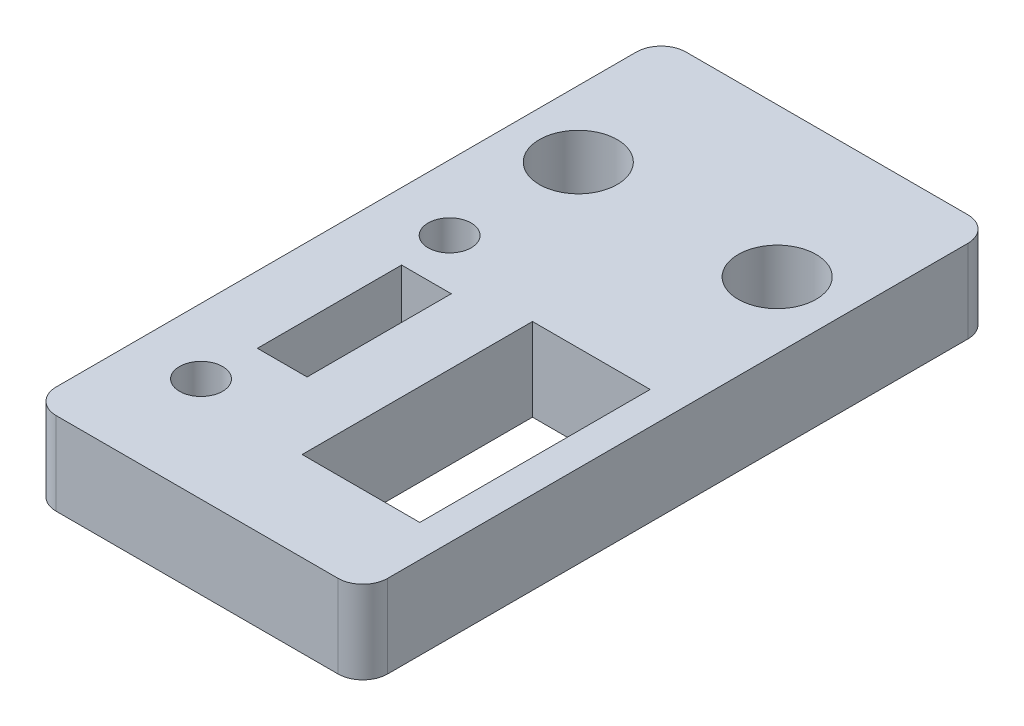
ISO-10303-21;
HEADER;
FILE_DESCRIPTION(('STEP AP214'),'2;1');
FILE_NAME('part.step','',(''),(''),'','','');
FILE_SCHEMA(('AUTOMOTIVE_DESIGN { 1 0 10303 214 1 1 1 1 }'));
ENDSEC;
DATA;
#1=APPLICATION_CONTEXT('core data for automotive mechanical design processes');
#2=APPLICATION_PROTOCOL_DEFINITION('international standard','automotive_design',2000,#1);
#3=PRODUCT_CONTEXT('',#1,'mechanical');
#4=PRODUCT('Part','Part','',(#3));
#5=PRODUCT_RELATED_PRODUCT_CATEGORY('part','',(#4));
#6=PRODUCT_DEFINITION_FORMATION('','',#4);
#7=PRODUCT_DEFINITION_CONTEXT('part definition',#1,'design');
#8=PRODUCT_DEFINITION('design','',#6,#7);
#9=PRODUCT_DEFINITION_SHAPE('','',#8);
#10=(LENGTH_UNIT() NAMED_UNIT(*) SI_UNIT(.MILLI.,.METRE.));
#11=(NAMED_UNIT(*) PLANE_ANGLE_UNIT() SI_UNIT($,.RADIAN.));
#12=(NAMED_UNIT(*) SI_UNIT($,.STERADIAN.) SOLID_ANGLE_UNIT());
#13=UNCERTAINTY_MEASURE_WITH_UNIT(LENGTH_MEASURE(1.E-05),#10,'distance_accuracy_value','');
#14=(GEOMETRIC_REPRESENTATION_CONTEXT(3) GLOBAL_UNCERTAINTY_ASSIGNED_CONTEXT((#13)) GLOBAL_UNIT_ASSIGNED_CONTEXT((#10,
#11,#12)) REPRESENTATION_CONTEXT('',''));
#15=CARTESIAN_POINT('',(0.,0.,0.));
#16=DIRECTION('',(0.,0.,1.));
#17=DIRECTION('',(1.,0.,0.));
#18=AXIS2_PLACEMENT_3D('',#15,#16,#17);
#19=CARTESIAN_POINT('',(-236.,67.49994211399,3.5));
#20=DIRECTION('',(0.,1.,0.));
#21=DIRECTION('',(0.,0.,1.));
#22=AXIS2_PLACEMENT_3D('',#19,#20,#21);
#23=PLANE('',#22);
#24=CARTESIAN_POINT('',(-230.,67.49994211399,-8.));
#25=DIRECTION('',(0.,1.,0.));
#26=DIRECTION('',(0.,0.,1.));
#27=AXIS2_PLACEMENT_3D('',#24,#25,#26);
#28=CIRCLE('',#27,2.35);
#29=CARTESIAN_POINT('',(-230.,67.49994211399,-5.65));
#30=VERTEX_POINT('',#29);
#31=EDGE_CURVE('E201',#30,#30,#28,.F.);
#32=ORIENTED_EDGE('',*,*,#31,.T.);
#33=EDGE_LOOP('',(#32));
#34=FACE_BOUND('',#33,.T.);
#35=CARTESIAN_POINT('',(-242.,67.49994211399,-8.));
#36=DIRECTION('',(0.,1.,0.));
#37=DIRECTION('',(0.,0.,1.));
#38=AXIS2_PLACEMENT_3D('',#35,#36,#37);
#39=CIRCLE('',#38,2.35);
#40=CARTESIAN_POINT('',(-242.,67.49994211399,-5.65));
#41=VERTEX_POINT('',#40);
#42=EDGE_CURVE('E197',#41,#41,#39,.F.);
#43=ORIENTED_EDGE('',*,*,#42,.T.);
#44=EDGE_LOOP('',(#43));
#45=FACE_BOUND('',#44,.T.);
#46=CARTESIAN_POINT('',(-227.5,67.49994211399,-15.5));
#47=DIRECTION('',(0.,-1.,0.));
#48=DIRECTION('',(0.,0.,-1.));
#49=AXIS2_PLACEMENT_3D('',#46,#47,#48);
#50=CIRCLE('',#49,1.5);
#51=CARTESIAN_POINT('',(-227.5,67.49994211399,-17.));
#52=VERTEX_POINT('',#51);
#53=CARTESIAN_POINT('',(-226.,67.49994211399,-15.5));
#54=VERTEX_POINT('',#53);
#55=EDGE_CURVE('E145',#52,#54,#50,.T.);
#56=ORIENTED_EDGE('',*,*,#55,.F.);
#57=DIRECTION('',(-1.,0.,0.));
#58=VECTOR('',#57,1.);
#59=CARTESIAN_POINT('',(-246.,67.49994211399,-17.));
#60=LINE('',#59,#58);
#61=CARTESIAN_POINT('',(-244.5,67.49994211399,-17.));
#62=VERTEX_POINT('',#61);
#63=EDGE_CURVE('E141',#62,#52,#60,.F.);
#64=ORIENTED_EDGE('',*,*,#63,.F.);
#65=CARTESIAN_POINT('',(-244.5,67.49994211399,-15.5));
#66=DIRECTION('',(0.,-1.,0.));
#67=DIRECTION('',(0.,0.,-1.));
#68=AXIS2_PLACEMENT_3D('',#65,#66,#67);
#69=CIRCLE('',#68,1.5);
#70=CARTESIAN_POINT('',(-246.,67.49994211399,-15.5));
#71=VERTEX_POINT('',#70);
#72=EDGE_CURVE('E20',#71,#62,#69,.T.);
#73=ORIENTED_EDGE('',*,*,#72,.F.);
#74=DIRECTION('',(0.,0.,1.));
#75=VECTOR('',#74,1.);
#76=CARTESIAN_POINT('',(-246.,67.49994211399,24.));
#77=LINE('',#76,#75);
#78=CARTESIAN_POINT('',(-246.,67.49994211399,19.5));
#79=VERTEX_POINT('',#78);
#80=EDGE_CURVE('E128',#79,#71,#77,.F.);
#81=ORIENTED_EDGE('',*,*,#80,.F.);
#82=CARTESIAN_POINT('',(-244.5,67.49994211399,19.5));
#83=DIRECTION('',(0.,-1.,0.));
#84=DIRECTION('',(0.,0.,-1.));
#85=AXIS2_PLACEMENT_3D('',#82,#83,#84);
#86=CIRCLE('',#85,1.5);
#87=CARTESIAN_POINT('',(-244.5,67.49994211399,21.));
#88=VERTEX_POINT('',#87);
#89=EDGE_CURVE('E208',#88,#79,#86,.T.);
#90=ORIENTED_EDGE('',*,*,#89,.F.);
#91=DIRECTION('',(1.,0.,0.));
#92=VECTOR('',#91,1.);
#93=CARTESIAN_POINT('',(-226.,67.49994211399,21.));
#94=LINE('',#93,#92);
#95=CARTESIAN_POINT('',(-227.5,67.49994211399,21.));
#96=VERTEX_POINT('',#95);
#97=EDGE_CURVE('E162',#96,#88,#94,.F.);
#98=ORIENTED_EDGE('',*,*,#97,.F.);
#99=CARTESIAN_POINT('',(-227.5,67.49994211399,19.5));
#100=DIRECTION('',(0.,-1.,0.));
#101=DIRECTION('',(0.,0.,-1.));
#102=AXIS2_PLACEMENT_3D('',#99,#100,#101);
#103=CIRCLE('',#102,1.5);
#104=CARTESIAN_POINT('',(-226.,67.49994211399,19.5));
#105=VERTEX_POINT('',#104);
#106=EDGE_CURVE('E207',#105,#96,#103,.T.);
#107=ORIENTED_EDGE('',*,*,#106,.F.);
#108=DIRECTION('',(0.,0.,-1.));
#109=VECTOR('',#108,1.);
#110=CARTESIAN_POINT('',(-226.,67.49994211399,-17.));
#111=LINE('',#110,#109);
#112=EDGE_CURVE('E158',#54,#105,#111,.F.);
#113=ORIENTED_EDGE('',*,*,#112,.F.);
#114=EDGE_LOOP('',(#56,#64,#73,#81,#90,#98,#107,#113));
#115=FACE_BOUND('',#114,.T.);
#116=CARTESIAN_POINT('',(-242.05,67.49994211399,14.7129502600828));
#117=DIRECTION('',(0.,1.,0.));
#118=DIRECTION('',(0.,0.,1.));
#119=AXIS2_PLACEMENT_3D('',#116,#117,#118);
#120=CIRCLE('',#119,1.3);
#121=CARTESIAN_POINT('',(-242.05,67.49994211399,16.0129502600828));
#122=VERTEX_POINT('',#121);
#123=EDGE_CURVE('E190',#122,#122,#120,.F.);
#124=ORIENTED_EDGE('',*,*,#123,.T.);
#125=EDGE_LOOP('',(#124));
#126=FACE_BOUND('',#125,.T.);
#127=CARTESIAN_POINT('',(-242.05,67.49994211399,-0.287049739917195));
#128=DIRECTION('',(0.,1.,0.));
#129=DIRECTION('',(0.,0.,1.));
#130=AXIS2_PLACEMENT_3D('',#127,#128,#129);
#131=CIRCLE('',#130,1.3);
#132=CARTESIAN_POINT('',(-242.05,67.49994211399,1.01295026008281));
#133=VERTEX_POINT('',#132);
#134=EDGE_CURVE('E193',#133,#133,#131,.F.);
#135=ORIENTED_EDGE('',*,*,#134,.T.);
#136=EDGE_LOOP('',(#135));
#137=FACE_BOUND('',#136,.T.);
#138=DIRECTION('',(0.,0.,-1.));
#139=VECTOR('',#138,1.);
#140=CARTESIAN_POINT('',(-238.95,67.49994211399,2.71295026008286));
#141=LINE('',#140,#139);
#142=CARTESIAN_POINT('',(-238.95,67.49994211399,2.71295026008286));
#143=VERTEX_POINT('',#142);
#144=CARTESIAN_POINT('',(-238.95,67.49994211399,11.4129502600829));
#145=VERTEX_POINT('',#144);
#146=EDGE_CURVE('E231',#143,#145,#141,.F.);
#147=ORIENTED_EDGE('',*,*,#146,.T.);
#148=DIRECTION('',(1.,0.,0.));
#149=VECTOR('',#148,1.);
#150=CARTESIAN_POINT('',(-238.95,67.49994211399,11.4129502600829));
#151=LINE('',#150,#149);
#152=CARTESIAN_POINT('',(-241.95,67.49994211399,11.4129502600829));
#153=VERTEX_POINT('',#152);
#154=EDGE_CURVE('E196',#145,#153,#151,.F.);
#155=ORIENTED_EDGE('',*,*,#154,.T.);
#156=DIRECTION('',(0.,0.,1.));
#157=VECTOR('',#156,1.);
#158=CARTESIAN_POINT('',(-241.95,67.49994211399,11.4129502600829));
#159=LINE('',#158,#157);
#160=CARTESIAN_POINT('',(-241.95,67.49994211399,2.71295026008286));
#161=VERTEX_POINT('',#160);
#162=EDGE_CURVE('E241',#153,#161,#159,.F.);
#163=ORIENTED_EDGE('',*,*,#162,.T.);
#164=DIRECTION('',(-1.,0.,0.));
#165=VECTOR('',#164,1.);
#166=CARTESIAN_POINT('',(-241.95,67.49994211399,2.71295026008286));
#167=LINE('',#166,#165);
#168=EDGE_CURVE('E236',#161,#143,#167,.F.);
#169=ORIENTED_EDGE('',*,*,#168,.T.);
#170=EDGE_LOOP('',(#147,#155,#163,#169));
#171=FACE_BOUND('',#170,.T.);
#172=DIRECTION('',(1.,0.,0.));
#173=VECTOR('',#172,1.);
#174=CARTESIAN_POINT('',(-229.95,67.49994211399,15.6129502600828));
#175=LINE('',#174,#173);
#176=CARTESIAN_POINT('',(-227.95,67.49994211399,15.6129502600828));
#177=VERTEX_POINT('',#176);
#178=CARTESIAN_POINT('',(-235.05,67.49994211399,15.6129502600828));
#179=VERTEX_POINT('',#178);
#180=EDGE_CURVE('E200',#177,#179,#175,.F.);
#181=ORIENTED_EDGE('',*,*,#180,.T.);
#182=DIRECTION('',(0.,0.,1.));
#183=VECTOR('',#182,1.);
#184=CARTESIAN_POINT('',(-235.05,67.49994211399,15.6129502600828));
#185=LINE('',#184,#183);
#186=CARTESIAN_POINT('',(-235.05,67.49994211399,1.71295026008287));
#187=VERTEX_POINT('',#186);
#188=EDGE_CURVE('E257',#179,#187,#185,.F.);
#189=ORIENTED_EDGE('',*,*,#188,.T.);
#190=DIRECTION('',(-1.,0.,0.));
#191=VECTOR('',#190,1.);
#192=CARTESIAN_POINT('',(-235.05,67.49994211399,1.71295026008287));
#193=LINE('',#192,#191);
#194=CARTESIAN_POINT('',(-227.95,67.49994211399,1.71295026008287));
#195=VERTEX_POINT('',#194);
#196=EDGE_CURVE('E252',#187,#195,#193,.F.);
#197=ORIENTED_EDGE('',*,*,#196,.T.);
#198=DIRECTION('',(0.,0.,-1.));
#199=VECTOR('',#198,1.);
#200=CARTESIAN_POINT('',(-227.95,67.49994211399,1.71295026008287));
#201=LINE('',#200,#199);
#202=EDGE_CURVE('E246',#195,#177,#201,.F.);
#203=ORIENTED_EDGE('',*,*,#202,.T.);
#204=EDGE_LOOP('',(#181,#189,#197,#203));
#205=FACE_BOUND('',#204,.T.);
#206=ADVANCED_FACE('F17',(#34,#45,#115,#126,#137,#171,#205),#23,.T.);
#207=CARTESIAN_POINT('',(-246.,62.49994211399,-17.));
#208=DIRECTION('',(0.,0.,-1.));
#209=DIRECTION('',(-1.,0.,0.));
#210=AXIS2_PLACEMENT_3D('',#207,#208,#209);
#211=PLANE('',#210);
#212=DIRECTION('',(0.,-1.,0.));
#213=VECTOR('',#212,1.);
#214=CARTESIAN_POINT('',(-227.5,74.01794211399,-17.));
#215=LINE('',#214,#213);
#216=CARTESIAN_POINT('',(-227.5,62.49994211399,-17.));
#217=VERTEX_POINT('',#216);
#218=EDGE_CURVE('E206',#217,#52,#215,.F.);
#219=ORIENTED_EDGE('',*,*,#218,.F.);
#220=DIRECTION('',(1.,0.,0.));
#221=VECTOR('',#220,1.);
#222=CARTESIAN_POINT('',(-236.,62.49994211399,-17.));
#223=LINE('',#222,#221);
#224=CARTESIAN_POINT('',(-244.5,62.49994211399,-17.));
#225=VERTEX_POINT('',#224);
#226=EDGE_CURVE('E152',#217,#225,#223,.F.);
#227=ORIENTED_EDGE('',*,*,#226,.T.);
#228=DIRECTION('',(0.,-1.,0.));
#229=VECTOR('',#228,1.);
#230=CARTESIAN_POINT('',(-244.5,74.01794211399,-17.));
#231=LINE('',#230,#229);
#232=EDGE_CURVE('E137',#62,#225,#231,.T.);
#233=ORIENTED_EDGE('',*,*,#232,.F.);
#234=ORIENTED_EDGE('',*,*,#63,.T.);
#235=EDGE_LOOP('',(#219,#227,#233,#234));
#236=FACE_BOUND('',#235,.T.);
#237=ADVANCED_FACE('F151',(#236),#211,.T.);
#238=CARTESIAN_POINT('',(-244.5,74.01794211399,-15.5));
#239=DIRECTION('',(0.,-1.,0.));
#240=DIRECTION('',(0.,0.,-1.));
#241=AXIS2_PLACEMENT_3D('',#238,#239,#240);
#242=CYLINDRICAL_SURFACE('',#241,1.5);
#243=ORIENTED_EDGE('',*,*,#72,.T.);
#244=ORIENTED_EDGE('',*,*,#232,.T.);
#245=CARTESIAN_POINT('',(-244.5,62.49994211399,-15.5));
#246=DIRECTION('',(0.,-1.,0.));
#247=DIRECTION('',(0.,0.,-1.));
#248=AXIS2_PLACEMENT_3D('',#245,#246,#247);
#249=CIRCLE('',#248,1.5);
#250=CARTESIAN_POINT('',(-246.,62.49994211399,-15.5));
#251=VERTEX_POINT('',#250);
#252=EDGE_CURVE('E188',#225,#251,#249,.F.);
#253=ORIENTED_EDGE('',*,*,#252,.T.);
#254=DIRECTION('',(0.,1.,0.));
#255=VECTOR('',#254,1.);
#256=CARTESIAN_POINT('',(-246.,62.49994211399,-15.5));
#257=LINE('',#256,#255);
#258=EDGE_CURVE('E139',#71,#251,#257,.F.);
#259=ORIENTED_EDGE('',*,*,#258,.F.);
#260=EDGE_LOOP('',(#243,#244,#253,#259));
#261=FACE_BOUND('',#260,.T.);
#262=ADVANCED_FACE('F134',(#261),#242,.T.);
#263=CARTESIAN_POINT('',(-246.,62.49994211399,24.));
#264=DIRECTION('',(-1.,0.,0.));
#265=DIRECTION('',(0.,0.,1.));
#266=AXIS2_PLACEMENT_3D('',#263,#264,#265);
#267=PLANE('',#266);
#268=ORIENTED_EDGE('',*,*,#80,.T.);
#269=ORIENTED_EDGE('',*,*,#258,.T.);
#270=DIRECTION('',(0.,0.,1.));
#271=VECTOR('',#270,1.);
#272=CARTESIAN_POINT('',(-246.,62.49994211399,3.5));
#273=LINE('',#272,#271);
#274=CARTESIAN_POINT('',(-246.,62.49994211399,19.5));
#275=VERTEX_POINT('',#274);
#276=EDGE_CURVE('E187',#251,#275,#273,.T.);
#277=ORIENTED_EDGE('',*,*,#276,.T.);
#278=DIRECTION('',(0.,-1.,0.));
#279=VECTOR('',#278,1.);
#280=CARTESIAN_POINT('',(-246.,74.01794211399,19.5));
#281=LINE('',#280,#279);
#282=EDGE_CURVE('E164',#79,#275,#281,.T.);
#283=ORIENTED_EDGE('',*,*,#282,.F.);
#284=EDGE_LOOP('',(#268,#269,#277,#283));
#285=FACE_BOUND('',#284,.T.);
#286=ADVANCED_FACE('F214',(#285),#267,.T.);
#287=CARTESIAN_POINT('',(-244.5,74.01794211399,19.5));
#288=DIRECTION('',(0.,-1.,0.));
#289=DIRECTION('',(0.,0.,-1.));
#290=AXIS2_PLACEMENT_3D('',#287,#288,#289);
#291=CYLINDRICAL_SURFACE('',#290,1.5);
#292=ORIENTED_EDGE('',*,*,#89,.T.);
#293=ORIENTED_EDGE('',*,*,#282,.T.);
#294=CARTESIAN_POINT('',(-244.5,62.49994211399,19.5));
#295=DIRECTION('',(0.,-1.,0.));
#296=DIRECTION('',(0.,0.,-1.));
#297=AXIS2_PLACEMENT_3D('',#294,#295,#296);
#298=CIRCLE('',#297,1.5);
#299=CARTESIAN_POINT('',(-244.5,62.49994211399,21.));
#300=VERTEX_POINT('',#299);
#301=EDGE_CURVE('E184',#275,#300,#298,.F.);
#302=ORIENTED_EDGE('',*,*,#301,.T.);
#303=DIRECTION('',(0.,1.,0.));
#304=VECTOR('',#303,1.);
#305=CARTESIAN_POINT('',(-244.5,62.49994211399,21.));
#306=LINE('',#305,#304);
#307=EDGE_CURVE('E163',#88,#300,#306,.F.);
#308=ORIENTED_EDGE('',*,*,#307,.F.);
#309=EDGE_LOOP('',(#292,#293,#302,#308));
#310=FACE_BOUND('',#309,.T.);
#311=ADVANCED_FACE('F273',(#310),#291,.T.);
#312=CARTESIAN_POINT('',(-226.,62.49994211399,21.));
#313=DIRECTION('',(0.,0.,1.));
#314=DIRECTION('',(1.,0.,0.));
#315=AXIS2_PLACEMENT_3D('',#312,#313,#314);
#316=PLANE('',#315);
#317=ORIENTED_EDGE('',*,*,#307,.T.);
#318=DIRECTION('',(1.,0.,0.));
#319=VECTOR('',#318,1.);
#320=CARTESIAN_POINT('',(-236.,62.49994211399,21.));
#321=LINE('',#320,#319);
#322=CARTESIAN_POINT('',(-227.5,62.49994211399,21.));
#323=VERTEX_POINT('',#322);
#324=EDGE_CURVE('E183',#300,#323,#321,.T.);
#325=ORIENTED_EDGE('',*,*,#324,.T.);
#326=DIRECTION('',(0.,-1.,0.));
#327=VECTOR('',#326,1.);
#328=CARTESIAN_POINT('',(-227.5,74.01794211399,21.));
#329=LINE('',#328,#327);
#330=EDGE_CURVE('E160',#96,#323,#329,.T.);
#331=ORIENTED_EDGE('',*,*,#330,.F.);
#332=ORIENTED_EDGE('',*,*,#97,.T.);
#333=EDGE_LOOP('',(#317,#325,#331,#332));
#334=FACE_BOUND('',#333,.T.);
#335=ADVANCED_FACE('F269',(#334),#316,.T.);
#336=CARTESIAN_POINT('',(-227.5,74.01794211399,19.5));
#337=DIRECTION('',(0.,-1.,0.));
#338=DIRECTION('',(0.,0.,-1.));
#339=AXIS2_PLACEMENT_3D('',#336,#337,#338);
#340=CYLINDRICAL_SURFACE('',#339,1.5);
#341=ORIENTED_EDGE('',*,*,#106,.T.);
#342=ORIENTED_EDGE('',*,*,#330,.T.);
#343=CARTESIAN_POINT('',(-227.5,62.49994211399,19.5));
#344=DIRECTION('',(0.,-1.,0.));
#345=DIRECTION('',(0.,0.,-1.));
#346=AXIS2_PLACEMENT_3D('',#343,#344,#345);
#347=CIRCLE('',#346,1.5);
#348=CARTESIAN_POINT('',(-226.,62.49994211399,19.5));
#349=VERTEX_POINT('',#348);
#350=EDGE_CURVE('E180',#323,#349,#347,.F.);
#351=ORIENTED_EDGE('',*,*,#350,.T.);
#352=DIRECTION('',(0.,1.,0.));
#353=VECTOR('',#352,1.);
#354=CARTESIAN_POINT('',(-226.,62.49994211399,19.5));
#355=LINE('',#354,#353);
#356=EDGE_CURVE('E159',#105,#349,#355,.F.);
#357=ORIENTED_EDGE('',*,*,#356,.F.);
#358=EDGE_LOOP('',(#341,#342,#351,#357));
#359=FACE_BOUND('',#358,.T.);
#360=ADVANCED_FACE('F281',(#359),#340,.T.);
#361=CARTESIAN_POINT('',(-226.,62.49994211399,-17.));
#362=DIRECTION('',(1.,0.,0.));
#363=DIRECTION('',(0.,0.,-1.));
#364=AXIS2_PLACEMENT_3D('',#361,#362,#363);
#365=PLANE('',#364);
#366=ORIENTED_EDGE('',*,*,#112,.T.);
#367=ORIENTED_EDGE('',*,*,#356,.T.);
#368=DIRECTION('',(0.,0.,1.));
#369=VECTOR('',#368,1.);
#370=CARTESIAN_POINT('',(-226.,62.49994211399,3.5));
#371=LINE('',#370,#369);
#372=CARTESIAN_POINT('',(-226.,62.49994211399,-15.5));
#373=VERTEX_POINT('',#372);
#374=EDGE_CURVE('E179',#349,#373,#371,.F.);
#375=ORIENTED_EDGE('',*,*,#374,.T.);
#376=DIRECTION('',(0.,-1.,0.));
#377=VECTOR('',#376,1.);
#378=CARTESIAN_POINT('',(-226.,74.01794211399,-15.5));
#379=LINE('',#378,#377);
#380=EDGE_CURVE('E204',#54,#373,#379,.T.);
#381=ORIENTED_EDGE('',*,*,#380,.F.);
#382=EDGE_LOOP('',(#366,#367,#375,#381));
#383=FACE_BOUND('',#382,.T.);
#384=ADVANCED_FACE('F342',(#383),#365,.T.);
#385=CARTESIAN_POINT('',(-227.5,74.01794211399,-15.5));
#386=DIRECTION('',(0.,-1.,0.));
#387=DIRECTION('',(0.,0.,-1.));
#388=AXIS2_PLACEMENT_3D('',#385,#386,#387);
#389=CYLINDRICAL_SURFACE('',#388,1.5);
#390=ORIENTED_EDGE('',*,*,#55,.T.);
#391=ORIENTED_EDGE('',*,*,#380,.T.);
#392=CARTESIAN_POINT('',(-227.5,62.49994211399,-15.5));
#393=DIRECTION('',(0.,-1.,0.));
#394=DIRECTION('',(0.,0.,-1.));
#395=AXIS2_PLACEMENT_3D('',#392,#393,#394);
#396=CIRCLE('',#395,1.5);
#397=EDGE_CURVE('E176',#373,#217,#396,.F.);
#398=ORIENTED_EDGE('',*,*,#397,.T.);
#399=ORIENTED_EDGE('',*,*,#218,.T.);
#400=EDGE_LOOP('',(#390,#391,#398,#399));
#401=FACE_BOUND('',#400,.T.);
#402=ADVANCED_FACE('F338',(#401),#389,.T.);
#403=CARTESIAN_POINT('',(-230.,67.49994211399,-8.));
#404=DIRECTION('',(0.,1.,0.));
#405=DIRECTION('',(0.,0.,1.));
#406=AXIS2_PLACEMENT_3D('',#403,#404,#405);
#407=CYLINDRICAL_SURFACE('',#406,2.35);
#408=CARTESIAN_POINT('',(-230.,62.49994211399,-8.));
#409=DIRECTION('',(0.,1.,0.));
#410=DIRECTION('',(0.,0.,1.));
#411=AXIS2_PLACEMENT_3D('',#408,#409,#410);
#412=CIRCLE('',#411,2.35);
#413=CARTESIAN_POINT('',(-230.,62.49994211399,-5.65));
#414=VERTEX_POINT('',#413);
#415=EDGE_CURVE('E173',#414,#414,#412,.F.);
#416=ORIENTED_EDGE('',*,*,#415,.T.);
#417=EDGE_LOOP('',(#416));
#418=FACE_BOUND('',#417,.T.);
#419=ORIENTED_EDGE('',*,*,#31,.F.);
#420=EDGE_LOOP('',(#419));
#421=FACE_BOUND('',#420,.T.);
#422=ADVANCED_FACE('F334',(#418,#421),#407,.F.);
#423=CARTESIAN_POINT('',(-242.,67.49994211399,-8.));
#424=DIRECTION('',(0.,1.,0.));
#425=DIRECTION('',(0.,0.,1.));
#426=AXIS2_PLACEMENT_3D('',#423,#424,#425);
#427=CYLINDRICAL_SURFACE('',#426,2.35);
#428=CARTESIAN_POINT('',(-242.,62.49994211399,-8.));
#429=DIRECTION('',(0.,1.,0.));
#430=DIRECTION('',(0.,0.,1.));
#431=AXIS2_PLACEMENT_3D('',#428,#429,#430);
#432=CIRCLE('',#431,2.35);
#433=CARTESIAN_POINT('',(-242.,62.49994211399,-5.65));
#434=VERTEX_POINT('',#433);
#435=EDGE_CURVE('E169',#434,#434,#432,.F.);
#436=ORIENTED_EDGE('',*,*,#435,.T.);
#437=EDGE_LOOP('',(#436));
#438=FACE_BOUND('',#437,.T.);
#439=ORIENTED_EDGE('',*,*,#42,.F.);
#440=EDGE_LOOP('',(#439));
#441=FACE_BOUND('',#440,.T.);
#442=ADVANCED_FACE('F330',(#438,#441),#427,.F.);
#443=CARTESIAN_POINT('',(-229.95,67.99994211399,15.6129502600828));
#444=DIRECTION('',(0.,0.,1.));
#445=DIRECTION('',(1.,0.,0.));
#446=AXIS2_PLACEMENT_3D('',#443,#444,#445);
#447=PLANE('',#446);
#448=DIRECTION('',(0.,1.,0.));
#449=VECTOR('',#448,1.);
#450=CARTESIAN_POINT('',(-227.95,57.49994211399,15.6129502600828));
#451=LINE('',#450,#449);
#452=CARTESIAN_POINT('',(-227.95,62.49994211399,15.6129502600828));
#453=VERTEX_POINT('',#452);
#454=EDGE_CURVE('E243',#177,#453,#451,.F.);
#455=ORIENTED_EDGE('',*,*,#454,.T.);
#456=DIRECTION('',(1.,0.,0.));
#457=VECTOR('',#456,1.);
#458=CARTESIAN_POINT('',(-236.,62.49994211399,15.6129502600828));
#459=LINE('',#458,#457);
#460=CARTESIAN_POINT('',(-235.05,62.49994211399,15.6129502600828));
#461=VERTEX_POINT('',#460);
#462=EDGE_CURVE('E172',#453,#461,#459,.F.);
#463=ORIENTED_EDGE('',*,*,#462,.T.);
#464=DIRECTION('',(0.,1.,0.));
#465=VECTOR('',#464,1.);
#466=CARTESIAN_POINT('',(-235.05,67.99994211399,15.6129502600828));
#467=LINE('',#466,#465);
#468=EDGE_CURVE('E259',#461,#179,#467,.T.);
#469=ORIENTED_EDGE('',*,*,#468,.T.);
#470=ORIENTED_EDGE('',*,*,#180,.F.);
#471=EDGE_LOOP('',(#455,#463,#469,#470));
#472=FACE_BOUND('',#471,.T.);
#473=ADVANCED_FACE('F326',(#472),#447,.F.);
#474=CARTESIAN_POINT('',(-235.05,67.99994211399,15.6129502600828));
#475=DIRECTION('',(-1.,0.,0.));
#476=DIRECTION('',(0.,0.,1.));
#477=AXIS2_PLACEMENT_3D('',#474,#475,#476);
#478=PLANE('',#477);
#479=ORIENTED_EDGE('',*,*,#468,.F.);
#480=DIRECTION('',(0.,0.,1.));
#481=VECTOR('',#480,1.);
#482=CARTESIAN_POINT('',(-235.05,62.49994211399,3.5));
#483=LINE('',#482,#481);
#484=CARTESIAN_POINT('',(-235.05,62.49994211399,1.71295026008287));
#485=VERTEX_POINT('',#484);
#486=EDGE_CURVE('E359',#461,#485,#483,.F.);
#487=ORIENTED_EDGE('',*,*,#486,.T.);
#488=DIRECTION('',(0.,1.,0.));
#489=VECTOR('',#488,1.);
#490=CARTESIAN_POINT('',(-235.05,67.99994211399,1.71295026008287));
#491=LINE('',#490,#489);
#492=EDGE_CURVE('E254',#485,#187,#491,.T.);
#493=ORIENTED_EDGE('',*,*,#492,.T.);
#494=ORIENTED_EDGE('',*,*,#188,.F.);
#495=EDGE_LOOP('',(#479,#487,#493,#494));
#496=FACE_BOUND('',#495,.T.);
#497=ADVANCED_FACE('F322',(#496),#478,.F.);
#498=CARTESIAN_POINT('',(-235.05,67.99994211399,1.71295026008287));
#499=DIRECTION('',(0.,0.,-1.));
#500=DIRECTION('',(-1.,0.,0.));
#501=AXIS2_PLACEMENT_3D('',#498,#499,#500);
#502=PLANE('',#501);
#503=ORIENTED_EDGE('',*,*,#492,.F.);
#504=DIRECTION('',(1.,0.,0.));
#505=VECTOR('',#504,1.);
#506=CARTESIAN_POINT('',(-236.,62.49994211399,1.71295026008287));
#507=LINE('',#506,#505);
#508=CARTESIAN_POINT('',(-227.95,62.49994211399,1.71295026008287));
#509=VERTEX_POINT('',#508);
#510=EDGE_CURVE('E362',#485,#509,#507,.T.);
#511=ORIENTED_EDGE('',*,*,#510,.T.);
#512=DIRECTION('',(0.,1.,0.));
#513=VECTOR('',#512,1.);
#514=CARTESIAN_POINT('',(-227.95,57.49994211399,1.71295026008287));
#515=LINE('',#514,#513);
#516=EDGE_CURVE('E249',#509,#195,#515,.T.);
#517=ORIENTED_EDGE('',*,*,#516,.T.);
#518=ORIENTED_EDGE('',*,*,#196,.F.);
#519=EDGE_LOOP('',(#503,#511,#517,#518));
#520=FACE_BOUND('',#519,.T.);
#521=ADVANCED_FACE('F318',(#520),#502,.F.);
#522=CARTESIAN_POINT('',(-227.95,57.49994211399,1.71295026008287));
#523=DIRECTION('',(1.,0.,0.));
#524=DIRECTION('',(0.,0.,-1.));
#525=AXIS2_PLACEMENT_3D('',#522,#523,#524);
#526=PLANE('',#525);
#527=ORIENTED_EDGE('',*,*,#202,.F.);
#528=ORIENTED_EDGE('',*,*,#516,.F.);
#529=DIRECTION('',(0.,0.,1.));
#530=VECTOR('',#529,1.);
#531=CARTESIAN_POINT('',(-227.95,62.49994211399,3.5));
#532=LINE('',#531,#530);
#533=EDGE_CURVE('E365',#509,#453,#532,.T.);
#534=ORIENTED_EDGE('',*,*,#533,.T.);
#535=ORIENTED_EDGE('',*,*,#454,.F.);
#536=EDGE_LOOP('',(#527,#528,#534,#535));
#537=FACE_BOUND('',#536,.T.);
#538=ADVANCED_FACE('F314',(#537),#526,.F.);
#539=CARTESIAN_POINT('',(-241.95,67.99994211399,11.4129502600829));
#540=DIRECTION('',(-1.,0.,0.));
#541=DIRECTION('',(0.,0.,1.));
#542=AXIS2_PLACEMENT_3D('',#539,#540,#541);
#543=PLANE('',#542);
#544=DIRECTION('',(0.,1.,0.));
#545=VECTOR('',#544,1.);
#546=CARTESIAN_POINT('',(-241.95,67.99994211399,11.4129502600829));
#547=LINE('',#546,#545);
#548=CARTESIAN_POINT('',(-241.95,62.49994211399,11.4129502600829));
#549=VERTEX_POINT('',#548);
#550=EDGE_CURVE('E228',#153,#549,#547,.F.);
#551=ORIENTED_EDGE('',*,*,#550,.T.);
#552=DIRECTION('',(0.,0.,1.));
#553=VECTOR('',#552,1.);
#554=CARTESIAN_POINT('',(-241.95,62.49994211399,3.5));
#555=LINE('',#554,#553);
#556=CARTESIAN_POINT('',(-241.95,62.49994211399,2.71295026008286));
#557=VERTEX_POINT('',#556);
#558=EDGE_CURVE('E368',#549,#557,#555,.F.);
#559=ORIENTED_EDGE('',*,*,#558,.T.);
#560=DIRECTION('',(0.,1.,0.));
#561=VECTOR('',#560,1.);
#562=CARTESIAN_POINT('',(-241.95,67.99994211399,2.71295026008286));
#563=LINE('',#562,#561);
#564=EDGE_CURVE('E238',#557,#161,#563,.T.);
#565=ORIENTED_EDGE('',*,*,#564,.T.);
#566=ORIENTED_EDGE('',*,*,#162,.F.);
#567=EDGE_LOOP('',(#551,#559,#565,#566));
#568=FACE_BOUND('',#567,.T.);
#569=ADVANCED_FACE('F310',(#568),#543,.F.);
#570=CARTESIAN_POINT('',(-241.95,67.99994211399,2.71295026008286));
#571=DIRECTION('',(0.,0.,-1.));
#572=DIRECTION('',(-1.,0.,0.));
#573=AXIS2_PLACEMENT_3D('',#570,#571,#572);
#574=PLANE('',#573);
#575=ORIENTED_EDGE('',*,*,#564,.F.);
#576=DIRECTION('',(1.,0.,0.));
#577=VECTOR('',#576,1.);
#578=CARTESIAN_POINT('',(-236.,62.49994211399,2.71295026008286));
#579=LINE('',#578,#577);
#580=CARTESIAN_POINT('',(-238.95,62.49994211399,2.71295026008286));
#581=VERTEX_POINT('',#580);
#582=EDGE_CURVE('E371',#557,#581,#579,.T.);
#583=ORIENTED_EDGE('',*,*,#582,.T.);
#584=DIRECTION('',(0.,1.,0.));
#585=VECTOR('',#584,1.);
#586=CARTESIAN_POINT('',(-238.95,67.99994211399,2.71295026008286));
#587=LINE('',#586,#585);
#588=EDGE_CURVE('E233',#581,#143,#587,.T.);
#589=ORIENTED_EDGE('',*,*,#588,.T.);
#590=ORIENTED_EDGE('',*,*,#168,.F.);
#591=EDGE_LOOP('',(#575,#583,#589,#590));
#592=FACE_BOUND('',#591,.T.);
#593=ADVANCED_FACE('F306',(#592),#574,.F.);
#594=CARTESIAN_POINT('',(-238.95,67.99994211399,2.71295026008286));
#595=DIRECTION('',(1.,0.,0.));
#596=DIRECTION('',(0.,0.,-1.));
#597=AXIS2_PLACEMENT_3D('',#594,#595,#596);
#598=PLANE('',#597);
#599=ORIENTED_EDGE('',*,*,#588,.F.);
#600=DIRECTION('',(0.,0.,1.));
#601=VECTOR('',#600,1.);
#602=CARTESIAN_POINT('',(-238.95,62.49994211399,3.5));
#603=LINE('',#602,#601);
#604=CARTESIAN_POINT('',(-238.95,62.49994211399,11.4129502600829));
#605=VERTEX_POINT('',#604);
#606=EDGE_CURVE('E374',#581,#605,#603,.T.);
#607=ORIENTED_EDGE('',*,*,#606,.T.);
#608=DIRECTION('',(0.,1.,0.));
#609=VECTOR('',#608,1.);
#610=CARTESIAN_POINT('',(-238.95,67.99994211399,11.4129502600829));
#611=LINE('',#610,#609);
#612=EDGE_CURVE('E35',#605,#145,#611,.T.);
#613=ORIENTED_EDGE('',*,*,#612,.T.);
#614=ORIENTED_EDGE('',*,*,#146,.F.);
#615=EDGE_LOOP('',(#599,#607,#613,#614));
#616=FACE_BOUND('',#615,.T.);
#617=ADVANCED_FACE('F303',(#616),#598,.F.);
#618=CARTESIAN_POINT('',(-238.95,67.99994211399,11.4129502600829));
#619=DIRECTION('',(0.,0.,1.));
#620=DIRECTION('',(1.,0.,0.));
#621=AXIS2_PLACEMENT_3D('',#618,#619,#620);
#622=PLANE('',#621);
#623=ORIENTED_EDGE('',*,*,#612,.F.);
#624=DIRECTION('',(1.,0.,0.));
#625=VECTOR('',#624,1.);
#626=CARTESIAN_POINT('',(-236.,62.49994211399,11.4129502600829));
#627=LINE('',#626,#625);
#628=EDGE_CURVE('E168',#605,#549,#627,.F.);
#629=ORIENTED_EDGE('',*,*,#628,.T.);
#630=ORIENTED_EDGE('',*,*,#550,.F.);
#631=ORIENTED_EDGE('',*,*,#154,.F.);
#632=EDGE_LOOP('',(#623,#629,#630,#631));
#633=FACE_BOUND('',#632,.T.);
#634=ADVANCED_FACE('F299',(#633),#622,.F.);
#635=CARTESIAN_POINT('',(-242.05,61.99994211399,-0.287049739917195));
#636=DIRECTION('',(0.,1.,0.));
#637=DIRECTION('',(0.,0.,1.));
#638=AXIS2_PLACEMENT_3D('',#635,#636,#637);
#639=CYLINDRICAL_SURFACE('',#638,1.3);
#640=CARTESIAN_POINT('',(-242.05,62.49994211399,-0.287049739917195));
#641=DIRECTION('',(0.,1.,0.));
#642=DIRECTION('',(0.,0.,1.));
#643=AXIS2_PLACEMENT_3D('',#640,#641,#642);
#644=CIRCLE('',#643,1.3);
#645=CARTESIAN_POINT('',(-242.05,62.49994211399,1.01295026008281));
#646=VERTEX_POINT('',#645);
#647=EDGE_CURVE('E26',#646,#646,#644,.F.);
#648=ORIENTED_EDGE('',*,*,#647,.T.);
#649=EDGE_LOOP('',(#648));
#650=FACE_BOUND('',#649,.T.);
#651=ORIENTED_EDGE('',*,*,#134,.F.);
#652=EDGE_LOOP('',(#651));
#653=FACE_BOUND('',#652,.T.);
#654=ADVANCED_FACE('F291',(#650,#653),#639,.F.);
#655=CARTESIAN_POINT('',(-242.05,61.99994211399,14.7129502600828));
#656=DIRECTION('',(0.,1.,0.));
#657=DIRECTION('',(0.,0.,1.));
#658=AXIS2_PLACEMENT_3D('',#655,#656,#657);
#659=CYLINDRICAL_SURFACE('',#658,1.3);
#660=CARTESIAN_POINT('',(-242.05,62.49994211399,14.7129502600828));
#661=DIRECTION('',(0.,1.,0.));
#662=DIRECTION('',(0.,0.,1.));
#663=AXIS2_PLACEMENT_3D('',#660,#661,#662);
#664=CIRCLE('',#663,1.3);
#665=CARTESIAN_POINT('',(-242.05,62.49994211399,16.0129502600828));
#666=VERTEX_POINT('',#665);
#667=EDGE_CURVE('E10',#666,#666,#664,.F.);
#668=ORIENTED_EDGE('',*,*,#667,.T.);
#669=EDGE_LOOP('',(#668));
#670=FACE_BOUND('',#669,.T.);
#671=ORIENTED_EDGE('',*,*,#123,.F.);
#672=EDGE_LOOP('',(#671));
#673=FACE_BOUND('',#672,.T.);
#674=ADVANCED_FACE('F285',(#670,#673),#659,.F.);
#675=CARTESIAN_POINT('',(-236.,62.49994211399,3.5));
#676=DIRECTION('',(0.,1.,0.));
#677=DIRECTION('',(0.,0.,1.));
#678=AXIS2_PLACEMENT_3D('',#675,#676,#677);
#679=PLANE('',#678);
#680=ORIENTED_EDGE('',*,*,#667,.F.);
#681=EDGE_LOOP('',(#680));
#682=FACE_BOUND('',#681,.T.);
#683=ORIENTED_EDGE('',*,*,#647,.F.);
#684=EDGE_LOOP('',(#683));
#685=FACE_BOUND('',#684,.T.);
#686=ORIENTED_EDGE('',*,*,#606,.F.);
#687=ORIENTED_EDGE('',*,*,#582,.F.);
#688=ORIENTED_EDGE('',*,*,#558,.F.);
#689=ORIENTED_EDGE('',*,*,#628,.F.);
#690=EDGE_LOOP('',(#686,#687,#688,#689));
#691=FACE_BOUND('',#690,.T.);
#692=ORIENTED_EDGE('',*,*,#510,.F.);
#693=ORIENTED_EDGE('',*,*,#486,.F.);
#694=ORIENTED_EDGE('',*,*,#462,.F.);
#695=ORIENTED_EDGE('',*,*,#533,.F.);
#696=EDGE_LOOP('',(#692,#693,#694,#695));
#697=FACE_BOUND('',#696,.T.);
#698=ORIENTED_EDGE('',*,*,#435,.F.);
#699=EDGE_LOOP('',(#698));
#700=FACE_BOUND('',#699,.T.);
#701=ORIENTED_EDGE('',*,*,#415,.F.);
#702=EDGE_LOOP('',(#701));
#703=FACE_BOUND('',#702,.T.);
#704=ORIENTED_EDGE('',*,*,#374,.F.);
#705=ORIENTED_EDGE('',*,*,#350,.F.);
#706=ORIENTED_EDGE('',*,*,#324,.F.);
#707=ORIENTED_EDGE('',*,*,#301,.F.);
#708=ORIENTED_EDGE('',*,*,#276,.F.);
#709=ORIENTED_EDGE('',*,*,#252,.F.);
#710=ORIENTED_EDGE('',*,*,#226,.F.);
#711=ORIENTED_EDGE('',*,*,#397,.F.);
#712=EDGE_LOOP('',(#704,#705,#706,#707,#708,#709,#710,#711));
#713=FACE_BOUND('',#712,.T.);
#714=ADVANCED_FACE('F218',(#682,#685,#691,#697,#700,#703,#713),#679,.F.);
#715=CLOSED_SHELL('',(#206,#237,#262,#286,#311,#335,#360,#384,#402,#422,#442,#473,#497,#521,
#538,#569,#593,#617,#634,#654,#674,#714));
#716=MANIFOLD_SOLID_BREP('B1',#715);
#717=ADVANCED_BREP_SHAPE_REPRESENTATION('',(#18,#716),#14);
#718=SHAPE_DEFINITION_REPRESENTATION(#9,#717);
ENDSEC;
END-ISO-10303-21;
